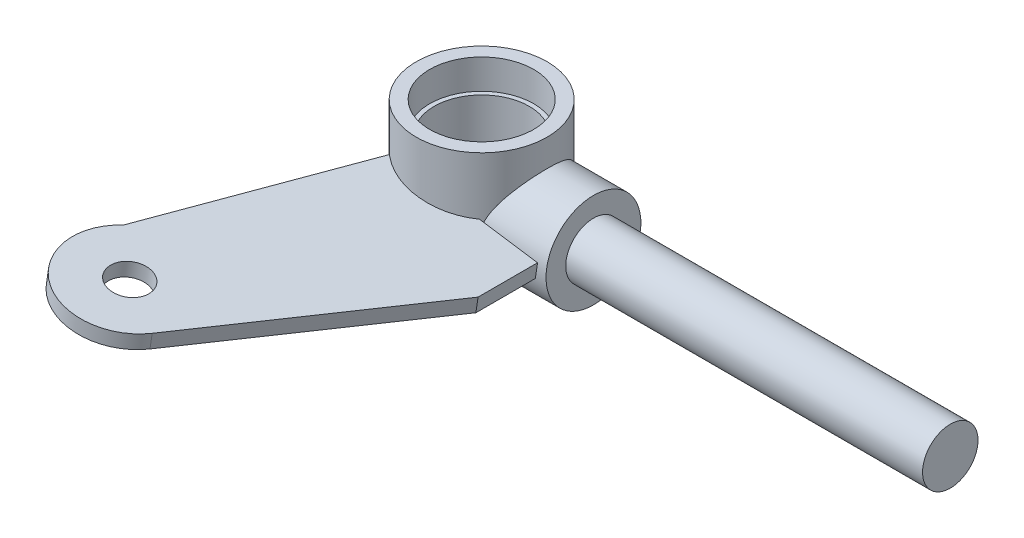
ISO-10303-21;
HEADER;
FILE_DESCRIPTION(('STEP AP214'),'2;1');
FILE_NAME('part.step','',(''),(''),'','','');
FILE_SCHEMA(('AUTOMOTIVE_DESIGN { 1 0 10303 214 1 1 1 1 }'));
ENDSEC;
DATA;
#1=APPLICATION_CONTEXT('core data for automotive mechanical design processes');
#2=APPLICATION_PROTOCOL_DEFINITION('international standard','automotive_design',2000,#1);
#3=PRODUCT_CONTEXT('',#1,'mechanical');
#4=PRODUCT('Part','Part','',(#3));
#5=PRODUCT_RELATED_PRODUCT_CATEGORY('part','',(#4));
#6=PRODUCT_DEFINITION_FORMATION('','',#4);
#7=PRODUCT_DEFINITION_CONTEXT('part definition',#1,'design');
#8=PRODUCT_DEFINITION('design','',#6,#7);
#9=PRODUCT_DEFINITION_SHAPE('','',#8);
#10=(LENGTH_UNIT() NAMED_UNIT(*) SI_UNIT(.MILLI.,.METRE.));
#11=(NAMED_UNIT(*) PLANE_ANGLE_UNIT() SI_UNIT($,.RADIAN.));
#12=(NAMED_UNIT(*) SI_UNIT($,.STERADIAN.) SOLID_ANGLE_UNIT());
#13=UNCERTAINTY_MEASURE_WITH_UNIT(LENGTH_MEASURE(1.E-05),#10,'distance_accuracy_value','');
#14=(GEOMETRIC_REPRESENTATION_CONTEXT(3) GLOBAL_UNCERTAINTY_ASSIGNED_CONTEXT((#13)) GLOBAL_UNIT_ASSIGNED_CONTEXT((#10,
#11,#12)) REPRESENTATION_CONTEXT('',''));
#15=CARTESIAN_POINT('',(0.,0.,0.));
#16=DIRECTION('',(0.,0.,1.));
#17=DIRECTION('',(1.,0.,0.));
#18=AXIS2_PLACEMENT_3D('',#15,#16,#17);
#19=CARTESIAN_POINT('',(-214.099905565846,-12.3825,0.));
#20=DIRECTION('',(0.,-1.,0.));
#21=DIRECTION('',(0.,0.,-1.));
#22=AXIS2_PLACEMENT_3D('',#19,#20,#21);
#23=PLANE('',#22);
#24=CARTESIAN_POINT('',(-200.129905565846,-12.3825,0.));
#25=DIRECTION('',(0.,1.,0.));
#26=DIRECTION('',(0.,0.,-1.));
#27=AXIS2_PLACEMENT_3D('',#24,#25,#26);
#28=CIRCLE('',#27,13.97);
#29=CARTESIAN_POINT('',(-200.129905565846,-12.3825,-13.97));
#30=VERTEX_POINT('',#29);
#31=EDGE_CURVE('E73',#30,#30,#28,.T.);
#32=ORIENTED_EDGE('',*,*,#31,.F.);
#33=EDGE_LOOP('',(#32));
#34=FACE_BOUND('',#33,.T.);
#35=CARTESIAN_POINT('',(-200.129905565846,-12.3825,0.));
#36=DIRECTION('',(0.,1.,0.));
#37=DIRECTION('',(0.,0.,-1.));
#38=AXIS2_PLACEMENT_3D('',#35,#36,#37);
#39=CIRCLE('',#38,11.1125);
#40=CARTESIAN_POINT('',(-200.129905565846,-12.3825,-11.1125));
#41=VERTEX_POINT('',#40);
#42=EDGE_CURVE('E11',#41,#41,#39,.T.);
#43=ORIENTED_EDGE('',*,*,#42,.T.);
#44=EDGE_LOOP('',(#43));
#45=FACE_BOUND('',#44,.T.);
#46=ADVANCED_FACE('F45',(#34,#45),#23,.T.);
#47=CARTESIAN_POINT('',(-200.129905565846,-12.3825,0.));
#48=DIRECTION('',(0.,-1.,0.));
#49=DIRECTION('',(0.,0.,-1.));
#50=AXIS2_PLACEMENT_3D('',#47,#48,#49);
#51=CYLINDRICAL_SURFACE('',#50,11.1125);
#52=ORIENTED_EDGE('',*,*,#42,.F.);
#53=EDGE_LOOP('',(#52));
#54=FACE_BOUND('',#53,.T.);
#55=CARTESIAN_POINT('',(-200.129905565846,-6.0325,0.));
#56=DIRECTION('',(0.,1.,0.));
#57=DIRECTION('',(0.,0.,-1.));
#58=AXIS2_PLACEMENT_3D('',#55,#56,#57);
#59=CIRCLE('',#58,11.1125);
#60=CARTESIAN_POINT('',(-200.129905565846,-6.0325,-11.1125));
#61=VERTEX_POINT('',#60);
#62=EDGE_CURVE('E51',#61,#61,#59,.T.);
#63=ORIENTED_EDGE('',*,*,#62,.T.);
#64=EDGE_LOOP('',(#63));
#65=FACE_BOUND('',#64,.T.);
#66=ADVANCED_FACE('F80',(#54,#65),#51,.F.);
#67=CARTESIAN_POINT('',(-211.242405565846,-6.0325,0.));
#68=DIRECTION('',(0.,-1.,0.));
#69=DIRECTION('',(0.,0.,-1.));
#70=AXIS2_PLACEMENT_3D('',#67,#68,#69);
#71=PLANE('',#70);
#72=ORIENTED_EDGE('',*,*,#62,.F.);
#73=EDGE_LOOP('',(#72));
#74=FACE_BOUND('',#73,.T.);
#75=CARTESIAN_POINT('',(-200.129905565846,-6.0325,0.));
#76=DIRECTION('',(0.,1.,0.));
#77=DIRECTION('',(0.,0.,-1.));
#78=AXIS2_PLACEMENT_3D('',#75,#76,#77);
#79=CIRCLE('',#78,10.16);
#80=CARTESIAN_POINT('',(-200.129905565846,-6.0325,-10.16));
#81=VERTEX_POINT('',#80);
#82=EDGE_CURVE('E55',#81,#81,#79,.T.);
#83=ORIENTED_EDGE('',*,*,#82,.T.);
#84=EDGE_LOOP('',(#83));
#85=FACE_BOUND('',#84,.T.);
#86=ADVANCED_FACE('F84',(#74,#85),#71,.T.);
#87=CARTESIAN_POINT('',(-200.129905565846,-12.3825,0.));
#88=DIRECTION('',(0.,-1.,0.));
#89=DIRECTION('',(0.,0.,-1.));
#90=AXIS2_PLACEMENT_3D('',#87,#88,#89);
#91=CYLINDRICAL_SURFACE('',#90,10.16);
#92=ORIENTED_EDGE('',*,*,#82,.F.);
#93=EDGE_LOOP('',(#92));
#94=FACE_BOUND('',#93,.T.);
#95=CARTESIAN_POINT('',(-200.129905565846,6.0325,0.));
#96=DIRECTION('',(0.,1.,0.));
#97=DIRECTION('',(0.,0.,-1.));
#98=AXIS2_PLACEMENT_3D('',#95,#96,#97);
#99=CIRCLE('',#98,10.16);
#100=CARTESIAN_POINT('',(-200.129905565846,6.0325,-10.16));
#101=VERTEX_POINT('',#100);
#102=EDGE_CURVE('E59',#101,#101,#99,.T.);
#103=ORIENTED_EDGE('',*,*,#102,.T.);
#104=EDGE_LOOP('',(#103));
#105=FACE_BOUND('',#104,.T.);
#106=ADVANCED_FACE('F89',(#94,#105),#91,.F.);
#107=CARTESIAN_POINT('',(-211.242405565846,6.0325,0.));
#108=DIRECTION('',(0.,1.,0.));
#109=DIRECTION('',(0.,0.,1.));
#110=AXIS2_PLACEMENT_3D('',#107,#108,#109);
#111=PLANE('',#110);
#112=ORIENTED_EDGE('',*,*,#102,.F.);
#113=EDGE_LOOP('',(#112));
#114=FACE_BOUND('',#113,.T.);
#115=CARTESIAN_POINT('',(-200.129905565846,6.0325,0.));
#116=DIRECTION('',(0.,1.,0.));
#117=DIRECTION('',(0.,0.,-1.));
#118=AXIS2_PLACEMENT_3D('',#115,#116,#117);
#119=CIRCLE('',#118,11.1125);
#120=CARTESIAN_POINT('',(-200.129905565846,6.0325,-11.1125));
#121=VERTEX_POINT('',#120);
#122=EDGE_CURVE('E64',#121,#121,#119,.T.);
#123=ORIENTED_EDGE('',*,*,#122,.T.);
#124=EDGE_LOOP('',(#123));
#125=FACE_BOUND('',#124,.T.);
#126=ADVANCED_FACE('F95',(#114,#125),#111,.T.);
#127=CARTESIAN_POINT('',(-200.129905565846,-12.3825,0.));
#128=DIRECTION('',(0.,-1.,0.));
#129=DIRECTION('',(0.,0.,-1.));
#130=AXIS2_PLACEMENT_3D('',#127,#128,#129);
#131=CYLINDRICAL_SURFACE('',#130,11.1125);
#132=ORIENTED_EDGE('',*,*,#122,.F.);
#133=EDGE_LOOP('',(#132));
#134=FACE_BOUND('',#133,.T.);
#135=CARTESIAN_POINT('',(-200.129905565846,12.3825,0.));
#136=DIRECTION('',(0.,1.,0.));
#137=DIRECTION('',(0.,0.,-1.));
#138=AXIS2_PLACEMENT_3D('',#135,#136,#137);
#139=CIRCLE('',#138,11.1125);
#140=CARTESIAN_POINT('',(-200.129905565846,12.3825,-11.1125));
#141=VERTEX_POINT('',#140);
#142=EDGE_CURVE('E67',#141,#141,#139,.T.);
#143=ORIENTED_EDGE('',*,*,#142,.T.);
#144=EDGE_LOOP('',(#143));
#145=FACE_BOUND('',#144,.T.);
#146=ADVANCED_FACE('F99',(#134,#145),#131,.F.);
#147=CARTESIAN_POINT('',(-214.099905565846,12.3825,0.));
#148=DIRECTION('',(0.,1.,0.));
#149=DIRECTION('',(0.,0.,1.));
#150=AXIS2_PLACEMENT_3D('',#147,#148,#149);
#151=PLANE('',#150);
#152=ORIENTED_EDGE('',*,*,#142,.F.);
#153=EDGE_LOOP('',(#152));
#154=FACE_BOUND('',#153,.T.);
#155=CARTESIAN_POINT('',(-200.129905565846,12.3825,0.));
#156=DIRECTION('',(0.,1.,0.));
#157=DIRECTION('',(0.,0.,-1.));
#158=AXIS2_PLACEMENT_3D('',#155,#156,#157);
#159=CIRCLE('',#158,13.97);
#160=CARTESIAN_POINT('',(-200.129905565846,12.3825,-13.97));
#161=VERTEX_POINT('',#160);
#162=EDGE_CURVE('E70',#161,#161,#159,.T.);
#163=ORIENTED_EDGE('',*,*,#162,.T.);
#164=EDGE_LOOP('',(#163));
#165=FACE_BOUND('',#164,.T.);
#166=ADVANCED_FACE('F103',(#154,#165),#151,.T.);
#167=CARTESIAN_POINT('',(-200.129905565846,-12.3825,0.));
#168=DIRECTION('',(0.,-1.,0.));
#169=DIRECTION('',(0.,0.,-1.));
#170=AXIS2_PLACEMENT_3D('',#167,#168,#169);
#171=CYLINDRICAL_SURFACE('',#170,13.97);
#172=ORIENTED_EDGE('',*,*,#162,.F.);
#173=EDGE_LOOP('',(#172));
#174=FACE_BOUND('',#173,.T.);
#175=ORIENTED_EDGE('',*,*,#31,.T.);
#176=EDGE_LOOP('',(#175));
#177=FACE_BOUND('',#176,.T.);
#178=ADVANCED_FACE('F77',(#174,#177),#171,.T.);
#179=CLOSED_SHELL('',(#46,#66,#86,#106,#126,#146,#166,#178));
#180=MANIFOLD_SOLID_BREP('B2',#179);
#181=CARTESIAN_POINT('',(-176.264952782923,-3.56664109055751,0.));
#182=DIRECTION('',(-1.,0.,0.));
#183=DIRECTION('',(0.,0.,-1.));
#184=AXIS2_PLACEMENT_3D('',#181,#182,#183);
#185=CYLINDRICAL_SURFACE('',#184,10.1308937353786);
#186=CARTESIAN_POINT('',(-176.264952782923,-3.56664109055751,0.));
#187=DIRECTION('',(-1.,0.,0.));
#188=DIRECTION('',(0.,0.,1.));
#189=AXIS2_PLACEMENT_3D('',#186,#187,#188);
#190=CIRCLE('',#189,10.1308937353786);
#191=CARTESIAN_POINT('',(-176.264952782923,-3.56664109055751,10.1308937353787));
#192=VERTEX_POINT('',#191);
#193=EDGE_CURVE('E178',#192,#192,#190,.T.);
#194=ORIENTED_EDGE('',*,*,#193,.T.);
#195=EDGE_LOOP('',(#194));
#196=FACE_BOUND('',#195,.T.);
#197=CARTESIAN_POINT('',(-190.510867561843,-3.56664109055751,10.1308937353787));
#198=CARTESIAN_POINT('',(-190.510865170661,-3.80639849007304,10.1308925484275));
#199=CARTESIAN_POINT('',(-190.501857299438,-4.04617130452357,10.1223617673848));
#200=CARTESIAN_POINT('',(-190.466342566868,-4.52332005065299,10.088460451511));
#201=CARTESIAN_POINT('',(-190.439825688999,-4.76069453133077,10.0630802774652));
#202=CARTESIAN_POINT('',(-190.370675006353,-5.23127763039903,9.99603045747906));
#203=CARTESIAN_POINT('',(-190.328004015223,-5.46447532682341,9.95432321945608));
#204=CARTESIAN_POINT('',(-190.228623758473,-5.92461065115534,9.8554765170672));
#205=CARTESIAN_POINT('',(-190.171906399991,-6.15154458610549,9.79832815451213));
#206=CARTESIAN_POINT('',(-190.047637530093,-6.59500296099345,9.67039785709464));
#207=CARTESIAN_POINT('',(-189.980237734968,-6.81162484133087,9.59980439757007));
#208=CARTESIAN_POINT('',(-189.836383515067,-7.23689009378552,9.44539414340225));
#209=CARTESIAN_POINT('',(-189.759929955346,-7.4455342256309,9.36157861182486));
#210=CARTESIAN_POINT('',(-189.520233702876,-8.05899105580503,9.09139352136986));
#211=CARTESIAN_POINT('',(-189.34655692559,-8.45165774662794,8.88618852556372));
#212=CARTESIAN_POINT('',(-189.059175768392,-9.05057278524142,8.52232525593787));
#213=CARTESIAN_POINT('',(-188.949578453435,-9.26806242968695,8.37833864467594));
#214=CARTESIAN_POINT('',(-188.728261408459,-9.69069470769071,8.07456910940666));
#215=CARTESIAN_POINT('',(-188.616541509947,-9.89583635561966,7.91478492710447));
#216=CARTESIAN_POINT('',(-188.393199817875,-10.2935623005356,7.57966098880922));
#217=CARTESIAN_POINT('',(-188.281578334848,-10.4861301228153,7.40430150800251));
#218=CARTESIAN_POINT('',(-188.060696800817,-10.8578860164378,7.03851926498493));
#219=CARTESIAN_POINT('',(-187.951436929129,-11.0370730743084,6.84809536402511));
#220=CARTESIAN_POINT('',(-187.717479969809,-11.4131649892626,6.41588768798284));
#221=CARTESIAN_POINT('',(-187.593667666429,-11.6072125319033,6.17112054980705));
#222=CARTESIAN_POINT('',(-187.355450590306,-11.9737930574009,5.66156410722473));
#223=CARTESIAN_POINT('',(-187.241047737734,-12.1463216526137,5.39677073715653));
#224=CARTESIAN_POINT('',(-187.025066254435,-12.4674846211503,4.8487799701303));
#225=CARTESIAN_POINT('',(-186.92346539792,-12.6161605317473,4.56561579931963));
#226=CARTESIAN_POINT('',(-186.73600514527,-12.8876020711898,3.98221905452539));
#227=CARTESIAN_POINT('',(-186.650138189377,-13.0103801476271,3.6819947688406));
#228=CARTESIAN_POINT('',(-186.518894006397,-13.1966336019867,3.15477503796828));
#229=CARTESIAN_POINT('',(-186.46895505328,-13.2670334245227,2.93133323530669));
#230=CARTESIAN_POINT('',(-186.379529710498,-13.392570600585,2.47817568608821));
#231=CARTESIAN_POINT('',(-186.340040970482,-13.4477113861407,2.2484613631241));
#232=CARTESIAN_POINT('',(-186.272337240398,-13.5419798008082,1.78428620306751));
#233=CARTESIAN_POINT('',(-186.244114931068,-13.5811178265519,1.5498285518643));
#234=CARTESIAN_POINT('',(-186.199511188905,-13.6428731553088,1.07761343482733));
#235=CARTESIAN_POINT('',(-186.183130169543,-13.6654898814359,0.839855854062936));
#236=CARTESIAN_POINT('',(-186.162553510575,-13.6938878916493,0.362262652436685));
#237=CARTESIAN_POINT('',(-186.158385723091,-13.6996306950487,0.12242353087556));
#238=CARTESIAN_POINT('',(-186.162409740995,-13.6940815897164,-0.356951834590637));
#239=CARTESIAN_POINT('',(-186.170601498993,-13.682789746303,-0.596488079653545));
#240=CARTESIAN_POINT('',(-186.199161231456,-13.6433434302408,-1.07348204017368));
#241=CARTESIAN_POINT('',(-186.219531871128,-13.6151852665927,-1.31093928912261));
#242=CARTESIAN_POINT('',(-186.271999678066,-13.5424266781346,-1.78199605263436));
#243=CARTESIAN_POINT('',(-186.304096812869,-13.4978262988436,-2.01559557787512));
#244=CARTESIAN_POINT('',(-186.378250939355,-13.3943252629383,-2.47073456285514));
#245=CARTESIAN_POINT('',(-186.419994875835,-13.3358728600535,-2.69242764401206));
#246=CARTESIAN_POINT('',(-186.513125256935,-13.2047397005971,-3.12956162592219));
#247=CARTESIAN_POINT('',(-186.564515070187,-13.132053972933,-3.34500031200946));
#248=CARTESIAN_POINT('',(-186.676004174886,-12.9732751607129,-3.76847042647943));
#249=CARTESIAN_POINT('',(-186.736101143764,-12.8871856510606,-3.97650381179521));
#250=CARTESIAN_POINT('',(-186.864049919499,-12.702366642786,-4.3844844700079));
#251=CARTESIAN_POINT('',(-186.9319045359,-12.6036325631847,-4.58442877760946));
#252=CARTESIAN_POINT('',(-187.082180389752,-12.3827907472346,-4.9971150380558));
#253=CARTESIAN_POINT('',(-187.165382795245,-12.2593060849262,-5.20883565069019));
#254=CARTESIAN_POINT('',(-187.338640000657,-11.9987261472283,-5.62089044097813));
#255=CARTESIAN_POINT('',(-187.428697701676,-11.861625101942,-5.82121973456839));
#256=CARTESIAN_POINT('',(-187.614222384459,-11.5746637198013,-6.21007304769011));
#257=CARTESIAN_POINT('',(-187.709692632778,-11.4247956498306,-6.39858979053962));
#258=CARTESIAN_POINT('',(-187.904501848188,-11.1131238721971,-6.7633697865122));
#259=CARTESIAN_POINT('',(-188.003841256385,-10.9513188017592,-6.93963163609259));
#260=CARTESIAN_POINT('',(-188.223813109371,-10.5847977195688,-7.31169885898193));
#261=CARTESIAN_POINT('',(-188.344928514931,-10.3777434401458,-7.50492223431331));
#262=CARTESIAN_POINT('',(-188.587755657189,-9.94838845974053,-7.87326842070623));
#263=CARTESIAN_POINT('',(-188.709467508349,-9.72608471665142,-8.04838760260165));
#264=CARTESIAN_POINT('',(-188.950549143286,-9.26667224415712,-8.38002952893087));
#265=CARTESIAN_POINT('',(-189.069918408687,-9.02956028541537,-8.53654819525789));
#266=CARTESIAN_POINT('',(-189.302865192021,-8.54107815226735,-8.83013329096766));
#267=CARTESIAN_POINT('',(-189.416444239088,-8.28971177973054,-8.96720487334645));
#268=CARTESIAN_POINT('',(-189.695347709389,-7.62721997990816,-9.29241023498745));
#269=CARTESIAN_POINT('',(-189.853892509947,-7.20568192841436,-9.46596501358645));
#270=CARTESIAN_POINT('',(-190.060846906272,-6.55040855821285,-9.68427081004706));
#271=CARTESIAN_POINT('',(-190.124658015734,-6.32830056588316,-9.75000737366088));
#272=CARTESIAN_POINT('',(-190.239706427697,-5.87698619457917,-9.86668962366788));
#273=CARTESIAN_POINT('',(-190.290946242134,-5.64778124400931,-9.91763826528413));
#274=CARTESIAN_POINT('',(-190.37152959568,-5.22091458018934,-9.99688268890803));
#275=CARTESIAN_POINT('',(-190.403067701373,-5.02409582629009,-10.0275019956832));
#276=CARTESIAN_POINT('',(-190.454538892576,-4.6275136576214,-10.077175547512));
#277=CARTESIAN_POINT('',(-190.474474337349,-4.42775084996649,-10.0962321437387));
#278=CARTESIAN_POINT('',(-190.501947587473,-4.02671672226621,-10.1224349906279));
#279=CARTESIAN_POINT('',(-190.509493285881,-3.82544644474953,-10.1295888241473));
#280=CARTESIAN_POINT('',(-190.511898601351,-3.42275529878834,-10.1318727471276));
#281=CARTESIAN_POINT('',(-190.506757919964,-3.2213344269125,-10.1270025537211));
#282=CARTESIAN_POINT('',(-190.484021473576,-2.82015303979755,-10.1053481719862));
#283=CARTESIAN_POINT('',(-190.466444251103,-2.62039050009428,-10.0885817205351));
#284=CARTESIAN_POINT('',(-190.419558064362,-2.22359057700764,-10.0434606985891));
#285=CARTESIAN_POINT('',(-190.39024913301,-2.0265531859801,-10.015106160606));
#286=CARTESIAN_POINT('',(-190.320937429423,-1.6361160617716,-9.9472303117203));
#287=CARTESIAN_POINT('',(-190.280923122836,-1.44272049442085,-9.90769695372881));
#288=CARTESIAN_POINT('',(-190.191501744549,-1.06054152358299,-9.81799555196963));
#289=CARTESIAN_POINT('',(-190.142089340745,-0.871760807328801,-9.76782146921262));
#290=CARTESIAN_POINT('',(-190.013575712895,-0.423853421042502,-9.63495869026008));
#291=CARTESIAN_POINT('',(-189.930567664562,-0.167299199204758,-9.54734104960244));
#292=CARTESIAN_POINT('',(-189.752611346491,0.33430611751025,-9.35360629636576));
#293=CARTESIAN_POINT('',(-189.657663153956,0.579357286751399,-9.24748930340056));
#294=CARTESIAN_POINT('',(-189.459122891577,1.05799001089977,-9.01767125631352));
#295=CARTESIAN_POINT('',(-189.355515551459,1.2915500983756,-8.89393885548552));
#296=CARTESIAN_POINT('',(-189.142895831954,1.74644839226086,-8.62990435905117));
#297=CARTESIAN_POINT('',(-189.033884010833,1.96778785605097,-8.48960397280574));
#298=CARTESIAN_POINT('',(-188.809899428763,2.40435294955986,-8.18868526639419));
#299=CARTESIAN_POINT('',(-188.694845599498,2.61920935204988,-8.02759203023274));
#300=CARTESIAN_POINT('',(-188.464453549773,3.03539669583716,-7.68895804136306));
#301=CARTESIAN_POINT('',(-188.349115316403,3.23672701096218,-7.5114165281076));
#302=CARTESIAN_POINT('',(-188.120647266923,3.62509143227999,-7.14044990952773));
#303=CARTESIAN_POINT('',(-188.007515364398,3.81213958654222,-6.94704081063138));
#304=CARTESIAN_POINT('',(-187.785529093355,4.17142654750338,-6.54447239318096));
#305=CARTESIAN_POINT('',(-187.67667615877,4.34366041234396,-6.33530786212545));
#306=CARTESIAN_POINT('',(-187.470695034312,4.66403356177298,-5.91251250663101));
#307=CARTESIAN_POINT('',(-187.373252992555,4.81294498034246,-5.6996205530482));
#308=CARTESIAN_POINT('',(-187.186071368422,5.09523556233258,-5.26069786253673));
#309=CARTESIAN_POINT('',(-187.096327971032,5.2286224306741,-5.0346737274116));
#310=CARTESIAN_POINT('',(-186.92626599109,5.47872307569742,-4.57011857790838));
#311=CARTESIAN_POINT('',(-186.845948606755,5.59543473306985,-4.33158597904409));
#312=CARTESIAN_POINT('',(-186.696490807179,5.81081876001885,-3.8431096419196));
#313=CARTESIAN_POINT('',(-186.627350309506,5.90949126264096,-3.5931659878372));
#314=CARTESIAN_POINT('',(-186.501355467379,6.0881781687157,-3.08116744840379));
#315=CARTESIAN_POINT('',(-186.444609317258,6.16802871246312,-2.81902839880318));
#316=CARTESIAN_POINT('',(-186.345639301839,6.30667972615402,-2.28653086208384));
#317=CARTESIAN_POINT('',(-186.303415620167,6.36547992993114,-2.01617227108183));
#318=CARTESIAN_POINT('',(-186.234717877128,6.46089325607901,-1.46982675384621));
#319=CARTESIAN_POINT('',(-186.208230130106,6.49752565846373,-1.19384493490774));
#320=CARTESIAN_POINT('',(-186.171745097232,6.54793547020552,-0.638735201978661));
#321=CARTESIAN_POINT('',(-186.16174524821,6.56171643199589,-0.359607783789672));
#322=CARTESIAN_POINT('',(-186.158755529757,6.56583795252878,0.159413192084113));
#323=CARTESIAN_POINT('',(-186.163561801319,6.55921549763676,0.399277514995676));
#324=CARTESIAN_POINT('',(-186.185430467002,6.52903147048661,0.877354922388151));
#325=CARTESIAN_POINT('',(-186.2024914906,6.50547179242046,1.11556818850919));
#326=CARTESIAN_POINT('',(-186.248488565024,6.44177184925209,1.58859789337558));
#327=CARTESIAN_POINT('',(-186.277424884528,6.40163120900632,1.8234142551417));
#328=CARTESIAN_POINT('',(-186.346549683206,6.30534603610142,2.28804988925624));
#329=CARTESIAN_POINT('',(-186.386738517723,6.24920099804036,2.51786900355016));
#330=CARTESIAN_POINT('',(-186.47668308947,6.12286458200034,2.96678777092029));
#331=CARTESIAN_POINT('',(-186.526242285086,6.05296073537101,3.18600817588903));
#332=CARTESIAN_POINT('',(-186.634507789848,5.89923694826681,3.61726235028899));
#333=CARTESIAN_POINT('',(-186.693217276333,5.81541217323288,3.82929359210398));
#334=CARTESIAN_POINT('',(-186.818750872084,5.63472663802529,4.24514110928427));
#335=CARTESIAN_POINT('',(-186.885572493146,5.53786987411879,4.44895987820898));
#336=CARTESIAN_POINT('',(-187.026312378325,5.33189351278721,4.84783428956795));
#337=CARTESIAN_POINT('',(-187.100233178177,5.22276953127871,5.04288676400262));
#338=CARTESIAN_POINT('',(-187.264316770513,4.97776246672566,5.44900506020996));
#339=CARTESIAN_POINT('',(-187.355331631067,4.84025107136051,5.65874481038789));
#340=CARTESIAN_POINT('',(-187.543490283896,4.55148431377991,6.06575202179336));
#341=CARTESIAN_POINT('',(-187.640636717347,4.40022301627013,6.2630140339654));
#342=CARTESIAN_POINT('',(-187.839519797603,4.08468018068767,6.64482533350068));
#343=CARTESIAN_POINT('',(-187.941261903571,3.92038297231731,6.82935880653217));
#344=CARTESIAN_POINT('',(-188.147517879682,3.57969358465794,7.1850924332814));
#345=CARTESIAN_POINT('',(-188.252030967753,3.40330479623322,7.35629629651574));
#346=CARTESIAN_POINT('',(-188.481969990692,3.00449779613303,7.71623517005947));
#347=CARTESIAN_POINT('',(-188.60761836658,2.77967722820198,7.90217618090311));
#348=CARTESIAN_POINT('',(-188.857292609353,2.31421952225714,8.25443630149155));
#349=CARTESIAN_POINT('',(-188.981318054559,2.07357836777106,8.42075039824056));
#350=CARTESIAN_POINT('',(-189.224133308826,1.5769799699955,8.73293186636329));
#351=CARTESIAN_POINT('',(-189.34292542981,1.32102961008681,8.87880832982478));
#352=CARTESIAN_POINT('',(-189.571163708305,0.794270740970728,9.14905212486614));
#353=CARTESIAN_POINT('',(-189.680614111932,0.523469075096433,9.27342925523373));
#354=CARTESIAN_POINT('',(-189.927886014706,-0.147807927528755,9.54599963851675));
#355=CARTESIAN_POINT('',(-190.058799644939,-0.555714314304149,9.68286968729266));
#356=CARTESIAN_POINT('',(-190.222569691282,-1.18537456282062,9.84945002462023));
#357=CARTESIAN_POINT('',(-190.271689866527,-1.39798272775062,9.8984897074791));
#358=CARTESIAN_POINT('',(-190.35733148731,-1.82833914504426,9.98305180029199));
#359=CARTESIAN_POINT('',(-190.39385883294,-2.04608493905188,10.0185805413043));
#360=CARTESIAN_POINT('',(-190.452021634122,-2.48006028989114,10.074773994129));
#361=CARTESIAN_POINT('',(-190.473993411898,-2.69620084434266,10.0957749346338));
#362=CARTESIAN_POINT('',(-190.503419304707,-3.13043672258906,10.1238371131521));
#363=CARTESIAN_POINT('',(-190.510869737113,-3.34853252815357,10.1308948151543));
#364=CARTESIAN_POINT('',(-190.510867561843,-3.56664109055751,10.1308937353787));
#365=B_SPLINE_CURVE_WITH_KNOTS('',3,(#197,#198,#199,#200,#201,#202,#203,#204,#205,#206,#207,
#208,#209,#210,#211,#212,#213,#214,#215,#216,#217,#218,#219,#220,#221,#222,#223,#224,#225,#226,
#227,#228,#229,#230,#231,#232,#233,#234,#235,#236,#237,#238,#239,#240,#241,#242,#243,#244,#245,
#246,#247,#248,#249,#250,#251,#252,#253,#254,#255,#256,#257,#258,#259,#260,#261,#262,#263,#264,
#265,#266,#267,#268,#269,#270,#271,#272,#273,#274,#275,#276,#277,#278,#279,#280,#281,#282,#283,
#284,#285,#286,#287,#288,#289,#290,#291,#292,#293,#294,#295,#296,#297,#298,#299,#300,#301,#302,
#303,#304,#305,#306,#307,#308,#309,#310,#311,#312,#313,#314,#315,#316,#317,#318,#319,#320,#321,
#322,#323,#324,#325,#326,#327,#328,#329,#330,#331,#332,#333,#334,#335,#336,#337,#338,#339,#340,
#341,#342,#343,#344,#345,#346,#347,#348,#349,#350,#351,#352,#353,#354,#355,#356,#357,#358,#359,
#360,#361,#362,#363,#364),.UNSPECIFIED.,.T.,.F.,(4,2,2,2,2,2,2,2,2,2,2,2,2,2,2,2,2,2,2,2,2,2,2,
2,2,2,2,2,2,2,2,2,2,2,2,2,2,2,2,2,2,2,2,2,2,2,2,2,2,2,2,2,2,2,2,2,2,2,2,2,2,2,2,2,2,2,2,2,2,2,2,
2,2,2,2,2,2,2,2,2,2,2,2,4),(0.,0.718986430556502,1.43838453432068,2.15944884422623,
2.88092956821217,3.59295563755625,4.30491373027604,5.72776731350085,6.57598137740764,
7.42426305706004,8.27363476416965,9.12307073841017,10.1296948523243,11.1365238792831,
12.1415801146481,13.1461521712457,13.8640302461093,14.5817467259189,15.2989961777896,
16.0162706731741,16.7351796358587,17.4540858419387,18.1731494298418,18.8922110270861,
19.5905886992465,20.2892107213435,20.9876467331289,21.6863364996942,22.4621002275027,
23.2381940966427,24.0147614424422,24.7914175818404,25.714522601662,26.6378123097395,
27.5613040742839,28.4845506775028,29.9265069423248,30.6465965896972,31.3665422348896,
31.9709148179918,32.5751644661552,33.1790290192293,33.782907778455,34.3858880638182,
34.9888666574522,35.5924975564188,36.1964719585592,37.0457694927818,37.8950615357868,
38.7458842406101,39.5966192404727,40.4722840821963,41.3479894337663,42.2228220302062,
43.0979453368963,43.9295666705423,44.7607734897943,45.5920858561592,46.4233920910355,
47.2616882272785,48.099994962797,48.9375715455123,49.7750179082545,50.4941329360237,
51.2131675533241,51.9322184396432,52.6512920353434,53.3566862334085,54.0623259200509,
54.7677497129391,55.4734264179514,56.2730674837934,57.0730553775135,57.8740199357032,
58.6747607895957,59.6267026398152,60.5788871058234,61.5306466193494,62.4819711974511,
63.8255216151532,64.4958132474092,65.1657904012277,65.8196903157807,66.4737560383548),.UNSPECIFIED.);
#366=CARTESIAN_POINT('',(-190.510867561843,-3.56664109055751,10.1308937353787));
#367=VERTEX_POINT('',#366);
#368=EDGE_CURVE('E186',#367,#367,#365,.T.);
#369=ORIENTED_EDGE('',*,*,#368,.T.);
#370=EDGE_LOOP('',(#369));
#371=FACE_BOUND('',#370,.T.);
#372=ADVANCED_FACE('F175',(#196,#371),#185,.T.);
#373=CARTESIAN_POINT('',(-176.264952782923,-3.56664109055751,0.));
#374=DIRECTION('',(1.,0.,0.));
#375=DIRECTION('',(0.,0.,1.));
#376=AXIS2_PLACEMENT_3D('',#373,#374,#375);
#377=PLANE('',#376);
#378=CARTESIAN_POINT('',(-176.264952782923,-3.56664109055751,0.));
#379=DIRECTION('',(-1.,0.,0.));
#380=DIRECTION('',(0.,0.,1.));
#381=AXIS2_PLACEMENT_3D('',#378,#379,#380);
#382=CIRCLE('',#381,5.92106637307848);
#383=CARTESIAN_POINT('',(-176.264952782923,-3.56664109055751,-5.92106637307846));
#384=VERTEX_POINT('',#383);
#385=EDGE_CURVE('E44',#384,#384,#382,.T.);
#386=ORIENTED_EDGE('',*,*,#385,.T.);
#387=EDGE_LOOP('',(#386));
#388=FACE_BOUND('',#387,.T.);
#389=ORIENTED_EDGE('',*,*,#193,.F.);
#390=EDGE_LOOP('',(#389));
#391=FACE_BOUND('',#390,.T.);
#392=ADVANCED_FACE('F210',(#388,#391),#377,.T.);
#393=CARTESIAN_POINT('',(-200.129905565846,-12.3825,0.));
#394=DIRECTION('',(0.,-1.,0.));
#395=DIRECTION('',(0.,0.,-1.));
#396=AXIS2_PLACEMENT_3D('',#393,#394,#395);
#397=CYLINDRICAL_SURFACE('',#396,13.97);
#398=ORIENTED_EDGE('',*,*,#368,.F.);
#399=EDGE_LOOP('',(#398));
#400=FACE_BOUND('',#399,.T.);
#401=ADVANCED_FACE('F195',(#400),#397,.F.);
#402=CARTESIAN_POINT('',(-100.064952782923,-3.56664109055751,0.));
#403=DIRECTION('',(-1.,0.,0.));
#404=DIRECTION('',(0.,0.,-1.));
#405=AXIS2_PLACEMENT_3D('',#402,#403,#404);
#406=CYLINDRICAL_SURFACE('',#405,5.92106637307848);
#407=CARTESIAN_POINT('',(-100.064952782923,-3.56664109055751,0.));
#408=DIRECTION('',(-1.,0.,0.));
#409=DIRECTION('',(0.,0.,1.));
#410=AXIS2_PLACEMENT_3D('',#407,#408,#409);
#411=CIRCLE('',#410,5.92106637307848);
#412=CARTESIAN_POINT('',(-100.064952782923,-3.56664109055751,-5.92106637307847));
#413=VERTEX_POINT('',#412);
#414=EDGE_CURVE('E188',#413,#413,#411,.T.);
#415=CARTESIAN_POINT('',(-100.064952782923,-3.56664109055751,-5.92106637307847));
#416=CARTESIAN_POINT('',(-100.858702782923,-3.56664109055751,-5.92106637307847));
#417=CARTESIAN_POINT('',(-101.652452782923,-3.56664109055751,-5.92106637307847));
#418=CARTESIAN_POINT('',(-103.239952782923,-3.56664109055751,-5.92106637307847));
#419=CARTESIAN_POINT('',(-104.033702782923,-3.56664109055751,-5.92106637307847));
#420=CARTESIAN_POINT('',(-105.621202782923,-3.56664109055751,-5.92106637307847));
#421=CARTESIAN_POINT('',(-106.414952782923,-3.56664109055751,-5.92106637307847));
#422=CARTESIAN_POINT('',(-108.002452782923,-3.56664109055751,-5.92106637307847));
#423=CARTESIAN_POINT('',(-108.796202782923,-3.56664109055751,-5.92106637307847));
#424=CARTESIAN_POINT('',(-110.383702782923,-3.56664109055751,-5.92106637307847));
#425=CARTESIAN_POINT('',(-111.177452782923,-3.56664109055751,-5.92106637307847));
#426=CARTESIAN_POINT('',(-112.764952782923,-3.56664109055751,-5.92106637307847));
#427=CARTESIAN_POINT('',(-113.558702782923,-3.56664109055751,-5.92106637307847));
#428=CARTESIAN_POINT('',(-115.146202782923,-3.56664109055751,-5.92106637307847));
#429=CARTESIAN_POINT('',(-115.939952782923,-3.56664109055751,-5.92106637307847));
#430=CARTESIAN_POINT('',(-117.527452782923,-3.56664109055751,-5.92106637307847));
#431=CARTESIAN_POINT('',(-118.321202782923,-3.56664109055751,-5.92106637307847));
#432=CARTESIAN_POINT('',(-119.908702782923,-3.56664109055751,-5.92106637307847));
#433=CARTESIAN_POINT('',(-120.702452782923,-3.56664109055751,-5.92106637307847));
#434=CARTESIAN_POINT('',(-122.289952782923,-3.56664109055751,-5.92106637307847));
#435=CARTESIAN_POINT('',(-123.083702782923,-3.56664109055751,-5.92106637307847));
#436=CARTESIAN_POINT('',(-124.671202782923,-3.56664109055751,-5.92106637307847));
#437=CARTESIAN_POINT('',(-125.464952782923,-3.56664109055751,-5.92106637307847));
#438=CARTESIAN_POINT('',(-127.052452782923,-3.56664109055751,-5.92106637307847));
#439=CARTESIAN_POINT('',(-127.846202782923,-3.56664109055751,-5.92106637307847));
#440=CARTESIAN_POINT('',(-129.433702782923,-3.56664109055751,-5.92106637307847));
#441=CARTESIAN_POINT('',(-130.227452782923,-3.56664109055751,-5.92106637307847));
#442=CARTESIAN_POINT('',(-131.814952782923,-3.56664109055751,-5.92106637307847));
#443=CARTESIAN_POINT('',(-132.608702782923,-3.56664109055751,-5.92106637307847));
#444=CARTESIAN_POINT('',(-134.196202782923,-3.56664109055751,-5.92106637307847));
#445=CARTESIAN_POINT('',(-134.989952782923,-3.56664109055751,-5.92106637307847));
#446=CARTESIAN_POINT('',(-136.577452782923,-3.56664109055751,-5.92106637307847));
#447=CARTESIAN_POINT('',(-137.371202782923,-3.56664109055751,-5.92106637307847));
#448=CARTESIAN_POINT('',(-138.958702782923,-3.56664109055751,-5.92106637307847));
#449=CARTESIAN_POINT('',(-139.752452782923,-3.56664109055751,-5.92106637307847));
#450=CARTESIAN_POINT('',(-141.339952782923,-3.56664109055751,-5.92106637307847));
#451=CARTESIAN_POINT('',(-142.133702782923,-3.56664109055751,-5.92106637307847));
#452=CARTESIAN_POINT('',(-143.721202782923,-3.56664109055751,-5.92106637307847));
#453=CARTESIAN_POINT('',(-144.514952782923,-3.56664109055751,-5.92106637307847));
#454=CARTESIAN_POINT('',(-146.102452782923,-3.56664109055751,-5.92106637307847));
#455=CARTESIAN_POINT('',(-146.896202782923,-3.56664109055751,-5.92106637307847));
#456=CARTESIAN_POINT('',(-148.483702782923,-3.56664109055751,-5.92106637307847));
#457=CARTESIAN_POINT('',(-149.277452782923,-3.56664109055751,-5.92106637307847));
#458=CARTESIAN_POINT('',(-150.864952782923,-3.56664109055751,-5.92106637307847));
#459=CARTESIAN_POINT('',(-151.658702782923,-3.56664109055751,-5.92106637307847));
#460=CARTESIAN_POINT('',(-153.246202782923,-3.56664109055751,-5.92106637307847));
#461=CARTESIAN_POINT('',(-154.039952782923,-3.56664109055751,-5.92106637307847));
#462=CARTESIAN_POINT('',(-155.627452782923,-3.56664109055751,-5.92106637307847));
#463=CARTESIAN_POINT('',(-156.421202782923,-3.56664109055751,-5.92106637307847));
#464=CARTESIAN_POINT('',(-158.008702782923,-3.56664109055751,-5.92106637307847));
#465=CARTESIAN_POINT('',(-158.802452782923,-3.56664109055751,-5.92106637307847));
#466=CARTESIAN_POINT('',(-160.389952782923,-3.56664109055751,-5.92106637307847));
#467=CARTESIAN_POINT('',(-161.183702782923,-3.56664109055751,-5.92106637307846));
#468=CARTESIAN_POINT('',(-162.771202782923,-3.56664109055751,-5.92106637307846));
#469=CARTESIAN_POINT('',(-163.564952782923,-3.56664109055751,-5.92106637307846));
#470=CARTESIAN_POINT('',(-165.152452782923,-3.56664109055751,-5.92106637307846));
#471=CARTESIAN_POINT('',(-165.946202782923,-3.56664109055751,-5.92106637307846));
#472=CARTESIAN_POINT('',(-167.533702782923,-3.56664109055751,-5.92106637307846));
#473=CARTESIAN_POINT('',(-168.327452782923,-3.56664109055751,-5.92106637307846));
#474=CARTESIAN_POINT('',(-169.914952782923,-3.56664109055751,-5.92106637307846));
#475=CARTESIAN_POINT('',(-170.708702782923,-3.56664109055751,-5.92106637307846));
#476=CARTESIAN_POINT('',(-172.296202782923,-3.56664109055751,-5.92106637307846));
#477=CARTESIAN_POINT('',(-173.089952782923,-3.56664109055751,-5.92106637307846));
#478=CARTESIAN_POINT('',(-174.677452782923,-3.56664109055751,-5.92106637307846));
#479=CARTESIAN_POINT('',(-175.471202782923,-3.56664109055751,-5.92106637307846));
#480=CARTESIAN_POINT('',(-176.264952782923,-3.56664109055751,-5.92106637307846));
#481=B_SPLINE_CURVE_WITH_KNOTS('',3,(#415,#416,#417,#418,#419,#420,#421,#422,#423,#424,#425,
#426,#427,#428,#429,#430,#431,#432,#433,#434,#435,#436,#437,#438,#439,#440,#441,#442,#443,#444,
#445,#446,#447,#448,#449,#450,#451,#452,#453,#454,#455,#456,#457,#458,#459,#460,#461,#462,#463,
#464,#465,#466,#467,#468,#469,#470,#471,#472,#473,#474,#475,#476,#477,#478,#479,#480),
.UNSPECIFIED.,.F.,.F.,(4,2,2,2,2,2,2,2,2,2,2,2,2,2,2,2,2,2,2,2,2,2,2,2,2,2,2,2,2,2,2,2,4),(0.,
2.38124999999999,4.76249999999999,7.14374999999999,9.52499999999999,11.90625,14.2875,16.66875,
19.05,21.43125,23.8125,26.19375,28.575,30.95625,33.3375,35.71875,38.1,40.48125,42.8625,45.24375,
47.625,50.00625,52.3875,54.76875,57.15,59.53125,61.9125,64.29375,66.675,69.05625,71.4375,
73.81875,76.2),.UNSPECIFIED.);
#482=EDGE_CURVE('BSEAM199',#413,#384,#481,.T.);
#483=ORIENTED_EDGE('',*,*,#414,.T.);
#484=ORIENTED_EDGE('',*,*,#385,.F.);
#485=ORIENTED_EDGE('',*,*,#482,.T.);
#486=ORIENTED_EDGE('',*,*,#482,.F.);
#487=EDGE_LOOP('',(#483,#485,#484,#486));
#488=FACE_BOUND('',#487,.T.);
#489=ADVANCED_FACE('F199',(#488),#406,.T.);
#490=CARTESIAN_POINT('',(-100.064952782923,-3.56664109055751,0.));
#491=DIRECTION('',(1.,0.,0.));
#492=DIRECTION('',(0.,0.,1.));
#493=AXIS2_PLACEMENT_3D('',#490,#491,#492);
#494=PLANE('',#493);
#495=ORIENTED_EDGE('',*,*,#414,.F.);
#496=EDGE_LOOP('',(#495));
#497=FACE_BOUND('',#496,.T.);
#498=ADVANCED_FACE('F202',(#497),#494,.T.);
#499=CLOSED_SHELL('',(#372,#392,#401,#489,#498));
#500=MANIFOLD_SOLID_BREP('B6',#499);
#501=CARTESIAN_POINT('',(-200.364553006014,-1.57006268308705,0.));
#502=DIRECTION('',(0.147809411129611,0.989015863361917,0.));
#503=DIRECTION('',(0.989015863361917,-0.147809411129611,0.));
#504=AXIS2_PLACEMENT_3D('',#501,#502,#503);
#505=CYLINDRICAL_SURFACE('',#504,13.97);
#506=DIRECTION('',(0.147809411129611,0.989015863361917,0.));
#507=VECTOR('',#506,1.);
#508=CARTESIAN_POINT('',(-190.881582357771,-2.9873021422314,10.16));
#509=LINE('',#508,#507);
#510=CARTESIAN_POINT('',(-190.881582357771,-2.9873021422314,10.16));
#511=VERTEX_POINT('',#510);
#512=CARTESIAN_POINT('',(-190.412287477435,0.152823223942687,10.16));
#513=VERTEX_POINT('',#512);
#514=EDGE_CURVE('E257',#511,#513,#509,.T.);
#515=ORIENTED_EDGE('',*,*,#514,.F.);
#516=CARTESIAN_POINT('',(-200.364553006014,-1.57006268308705,0.));
#517=DIRECTION('',(-0.147809411129611,-0.989015863361917,0.));
#518=DIRECTION('',(0.989015863361917,-0.147809411129611,0.));
#519=AXIS2_PLACEMENT_3D('',#516,#517,#518);
#520=CIRCLE('',#519,13.97);
#521=CARTESIAN_POINT('',(-209.608300427437,-0.188575374737006,10.3829440153461));
#522=VERTEX_POINT('',#521);
#523=EDGE_CURVE('E365',#511,#522,#520,.T.);
#524=ORIENTED_EDGE('',*,*,#523,.T.);
#525=DIRECTION('',(0.147809411129611,0.989015863361917,0.));
#526=VECTOR('',#525,1.);
#527=CARTESIAN_POINT('',(-209.608300427437,-0.188575374737006,10.3829440153461));
#528=LINE('',#527,#526);
#529=CARTESIAN_POINT('',(-209.139005547101,2.95154999143708,10.3829440153461));
#530=VERTEX_POINT('',#529);
#531=EDGE_CURVE('E173',#522,#530,#528,.T.);
#532=ORIENTED_EDGE('',*,*,#531,.T.);
#533=CARTESIAN_POINT('',(-199.895258125678,1.57006268308704,0.));
#534=DIRECTION('',(-0.147809411129611,-0.989015863361917,0.));
#535=DIRECTION('',(0.989015863361917,-0.147809411129611,0.));
#536=AXIS2_PLACEMENT_3D('',#533,#534,#535);
#537=CIRCLE('',#536,13.97);
#538=EDGE_CURVE('E313',#513,#530,#537,.T.);
#539=ORIENTED_EDGE('',*,*,#538,.F.);
#540=EDGE_LOOP('',(#515,#524,#532,#539));
#541=FACE_BOUND('',#540,.T.);
#542=ADVANCED_FACE('F254',(#541),#505,.F.);
#543=CARTESIAN_POINT('',(-205.88066034594,-0.745674917585867,-1.73476149026001));
#544=DIRECTION('',(0.944388682248357,-0.1411398342248,0.297000949554387));
#545=DIRECTION('',(-0.300004089416815,0.,0.953937915345222));
#546=AXIS2_PLACEMENT_3D('',#543,#544,#545);
#547=PLANE('',#546);
#548=ORIENTED_EDGE('',*,*,#531,.F.);
#549=DIRECTION('',(-0.293738650542842,0.0438995354585693,0.95487718370678));
#550=VECTOR('',#549,1.);
#551=CARTESIAN_POINT('',(-205.88066034594,-0.745674917585867,-1.73476149026001));
#552=LINE('',#551,#550);
#553=CARTESIAN_POINT('',(-223.038031530256,1.81851138642878,54.0399288544201));
#554=VERTEX_POINT('',#553);
#555=EDGE_CURVE('E270',#522,#554,#552,.T.);
#556=ORIENTED_EDGE('',*,*,#555,.T.);
#557=DIRECTION('',(0.147809411129611,0.989015863361917,0.));
#558=VECTOR('',#557,1.);
#559=CARTESIAN_POINT('',(-223.038031530256,1.81851138642878,54.0399288544201));
#560=LINE('',#559,#558);
#561=CARTESIAN_POINT('',(-222.568736649919,4.95863675260287,54.0399288544201));
#562=VERTEX_POINT('',#561);
#563=EDGE_CURVE('E262',#554,#562,#560,.T.);
#564=ORIENTED_EDGE('',*,*,#563,.T.);
#565=DIRECTION('',(-0.293738650542842,0.0438995354585693,0.95487718370678));
#566=VECTOR('',#565,1.);
#567=CARTESIAN_POINT('',(-205.411365465604,2.39445044858822,-1.73476149026001));
#568=LINE('',#567,#566);
#569=EDGE_CURVE('E358',#530,#562,#568,.T.);
#570=ORIENTED_EDGE('',*,*,#569,.F.);
#571=EDGE_LOOP('',(#548,#556,#564,#570));
#572=FACE_BOUND('',#571,.T.);
#573=ADVANCED_FACE('F374',(#572),#547,.F.);
#574=CARTESIAN_POINT('',(-213.70055543932,0.423016234564858,62.0518224996405));
#575=DIRECTION('',(0.147809411129611,0.989015863361917,0.));
#576=DIRECTION('',(0.989015863361917,-0.147809411129611,0.));
#577=AXIS2_PLACEMENT_3D('',#574,#575,#576);
#578=CYLINDRICAL_SURFACE('',#577,12.3825);
#579=ORIENTED_EDGE('',*,*,#563,.F.);
#580=CARTESIAN_POINT('',(-213.70055543932,0.423016234564858,62.0518224996405));
#581=DIRECTION('',(-0.147809411129611,-0.989015863361917,0.));
#582=DIRECTION('',(0.989015863361917,-0.147809411129611,0.));
#583=AXIS2_PLACEMENT_3D('',#580,#581,#582);
#584=CIRCLE('',#583,12.3825);
#585=CARTESIAN_POINT('',(-202.959438158078,-1.1822544987251,67.9997474885302));
#586=VERTEX_POINT('',#585);
#587=EDGE_CURVE('E275',#586,#554,#584,.T.);
#588=ORIENTED_EDGE('',*,*,#587,.F.);
#589=DIRECTION('',(0.147809411129611,0.989015863361917,0.));
#590=VECTOR('',#589,1.);
#591=CARTESIAN_POINT('',(-202.959438158078,-1.1822544987251,67.9997474885302));
#592=LINE('',#591,#590);
#593=CARTESIAN_POINT('',(-202.490143277742,1.95787086744899,67.9997474885302));
#594=VERTEX_POINT('',#593);
#595=EDGE_CURVE('E339',#586,#594,#592,.T.);
#596=ORIENTED_EDGE('',*,*,#595,.T.);
#597=CARTESIAN_POINT('',(-213.231260558983,3.56314160073894,62.0518224996405));
#598=DIRECTION('',(-0.147809411129611,-0.989015863361917,0.));
#599=DIRECTION('',(0.989015863361917,-0.147809411129611,0.));
#600=AXIS2_PLACEMENT_3D('',#597,#598,#599);
#601=CIRCLE('',#600,12.3825);
#602=EDGE_CURVE('E356',#594,#562,#601,.T.);
#603=ORIENTED_EDGE('',*,*,#602,.T.);
#604=EDGE_LOOP('',(#579,#588,#596,#603));
#605=FACE_BOUND('',#604,.T.);
#606=ADVANCED_FACE('F372',(#605),#578,.T.);
#607=CARTESIAN_POINT('',(-174.026857659291,-5.50625762588314,14.5845755335089));
#608=DIRECTION('',(0.867443349989213,-0.12964027726953,0.480349282365417));
#609=DIRECTION('',(-0.484437405220754,0.,0.874825925783514));
#610=AXIS2_PLACEMENT_3D('',#607,#608,#609);
#611=PLANE('',#610);
#612=ORIENTED_EDGE('',*,*,#595,.F.);
#613=DIRECTION('',(-0.47507306021391,0.0710001445629636,0.877077286749023));
#614=VECTOR('',#613,1.);
#615=CARTESIAN_POINT('',(-174.026857659291,-5.50625762588314,14.5845755335089));
#616=LINE('',#615,#614);
#617=CARTESIAN_POINT('',(-178.509280457443,-4.83635505022919,22.86));
#618=VERTEX_POINT('',#617);
#619=EDGE_CURVE('E350',#618,#586,#616,.T.);
#620=ORIENTED_EDGE('',*,*,#619,.F.);
#621=DIRECTION('',(0.147809411129611,0.989015863361917,0.));
#622=VECTOR('',#621,1.);
#623=CARTESIAN_POINT('',(-178.509280457443,-4.83635505022919,22.86));
#624=LINE('',#623,#622);
#625=CARTESIAN_POINT('',(-178.039985577106,-1.6962296840551,22.86));
#626=VERTEX_POINT('',#625);
#627=EDGE_CURVE('E329',#618,#626,#624,.T.);
#628=ORIENTED_EDGE('',*,*,#627,.T.);
#629=DIRECTION('',(-0.47507306021391,0.0710001445629636,0.877077286749023));
#630=VECTOR('',#629,1.);
#631=CARTESIAN_POINT('',(-173.557562778954,-2.36613225970906,14.5845755335089));
#632=LINE('',#631,#630);
#633=EDGE_CURVE('E348',#626,#594,#632,.T.);
#634=ORIENTED_EDGE('',*,*,#633,.T.);
#635=EDGE_LOOP('',(#612,#620,#628,#634));
#636=FACE_BOUND('',#635,.T.);
#637=ADVANCED_FACE('F347',(#636),#611,.T.);
#638=CARTESIAN_POINT('',(-178.509280457443,-4.83635505022919,0.));
#639=DIRECTION('',(0.989015863361917,-0.147809411129611,0.));
#640=DIRECTION('',(-0.147809411129611,-0.989015863361917,0.));
#641=AXIS2_PLACEMENT_3D('',#638,#639,#640);
#642=PLANE('',#641);
#643=ORIENTED_EDGE('',*,*,#627,.F.);
#644=DIRECTION('',(0.,0.,1.));
#645=VECTOR('',#644,1.);
#646=CARTESIAN_POINT('',(-178.509280457443,-4.83635505022919,0.));
#647=LINE('',#646,#645);
#648=CARTESIAN_POINT('',(-178.509280457443,-4.83635505022919,10.16));
#649=VERTEX_POINT('',#648);
#650=EDGE_CURVE('E354',#649,#618,#647,.T.);
#651=ORIENTED_EDGE('',*,*,#650,.F.);
#652=DIRECTION('',(0.147809411129611,0.989015863361917,0.));
#653=VECTOR('',#652,1.);
#654=CARTESIAN_POINT('',(-178.509280457443,-4.83635505022919,10.16));
#655=LINE('',#654,#653);
#656=CARTESIAN_POINT('',(-178.039985577106,-1.6962296840551,10.16));
#657=VERTEX_POINT('',#656);
#658=EDGE_CURVE('E327',#649,#657,#655,.T.);
#659=ORIENTED_EDGE('',*,*,#658,.T.);
#660=DIRECTION('',(0.,0.,1.));
#661=VECTOR('',#660,1.);
#662=CARTESIAN_POINT('',(-178.039985577106,-1.6962296840551,0.));
#663=LINE('',#662,#661);
#664=EDGE_CURVE('E315',#657,#626,#663,.T.);
#665=ORIENTED_EDGE('',*,*,#664,.T.);
#666=EDGE_LOOP('',(#643,#651,#659,#665));
#667=FACE_BOUND('',#666,.T.);
#668=ADVANCED_FACE('F353',(#667),#642,.T.);
#669=CARTESIAN_POINT('',(-200.364553006014,-1.57006268308704,10.16));
#670=DIRECTION('',(0.,0.,1.));
#671=DIRECTION('',(-1.,0.,0.));
#672=AXIS2_PLACEMENT_3D('',#669,#670,#671);
#673=PLANE('',#672);
#674=ORIENTED_EDGE('',*,*,#658,.F.);
#675=DIRECTION('',(-0.989015863361917,0.147809411129611,0.));
#676=VECTOR('',#675,1.);
#677=CARTESIAN_POINT('',(-200.364553006014,-1.57006268308704,10.16));
#678=LINE('',#677,#676);
#679=EDGE_CURVE('E326',#649,#511,#678,.T.);
#680=ORIENTED_EDGE('',*,*,#679,.T.);
#681=ORIENTED_EDGE('',*,*,#514,.T.);
#682=DIRECTION('',(-0.989015863361917,0.147809411129611,0.));
#683=VECTOR('',#682,1.);
#684=CARTESIAN_POINT('',(-199.895258125678,1.57006268308704,10.16));
#685=LINE('',#684,#683);
#686=EDGE_CURVE('E308',#657,#513,#685,.T.);
#687=ORIENTED_EDGE('',*,*,#686,.F.);
#688=EDGE_LOOP('',(#674,#680,#681,#687));
#689=FACE_BOUND('',#688,.T.);
#690=ADVANCED_FACE('F325',(#689),#673,.F.);
#691=CARTESIAN_POINT('',(-213.70055543932,0.423016234564858,62.0518224996405));
#692=DIRECTION('',(0.147809411129611,0.989015863361917,0.));
#693=DIRECTION('',(0.989015863361917,-0.147809411129611,0.));
#694=AXIS2_PLACEMENT_3D('',#691,#692,#693);
#695=CYLINDRICAL_SURFACE('',#694,4.12750000000001);
#696=CARTESIAN_POINT('',(-213.70055543932,0.423016234564858,62.0518224996405));
#697=DIRECTION('',(-0.147809411129611,-0.989015863361917,0.));
#698=DIRECTION('',(0.989015863361917,-0.147809411129611,0.));
#699=AXIS2_PLACEMENT_3D('',#696,#697,#698);
#700=CIRCLE('',#699,4.12750000000001);
#701=CARTESIAN_POINT('',(-209.618392463293,-0.187067109872612,62.0518224996405));
#702=VERTEX_POINT('',#701);
#703=EDGE_CURVE('E328',#702,#702,#700,.T.);
#704=ORIENTED_EDGE('',*,*,#703,.T.);
#705=EDGE_LOOP('',(#704));
#706=FACE_BOUND('',#705,.T.);
#707=CARTESIAN_POINT('',(-213.231260558983,3.56314160073894,62.0518224996405));
#708=DIRECTION('',(-0.147809411129611,-0.989015863361917,0.));
#709=DIRECTION('',(0.989015863361917,-0.147809411129611,0.));
#710=AXIS2_PLACEMENT_3D('',#707,#708,#709);
#711=CIRCLE('',#710,4.12750000000001);
#712=CARTESIAN_POINT('',(-209.149097582957,2.95305825630147,62.0518224996405));
#713=VERTEX_POINT('',#712);
#714=EDGE_CURVE('E362',#713,#713,#711,.T.);
#715=ORIENTED_EDGE('',*,*,#714,.F.);
#716=EDGE_LOOP('',(#715));
#717=FACE_BOUND('',#716,.T.);
#718=ADVANCED_FACE('F383',(#706,#717),#695,.F.);
#719=CARTESIAN_POINT('',(-200.364553006014,-1.57006268308704,0.));
#720=DIRECTION('',(0.147809411129611,0.989015863361917,0.));
#721=DIRECTION('',(0.989015863361917,-0.147809411129611,0.));
#722=AXIS2_PLACEMENT_3D('',#719,#720,#721);
#723=PLANE('',#722);
#724=ORIENTED_EDGE('',*,*,#523,.F.);
#725=ORIENTED_EDGE('',*,*,#679,.F.);
#726=ORIENTED_EDGE('',*,*,#650,.T.);
#727=ORIENTED_EDGE('',*,*,#619,.T.);
#728=ORIENTED_EDGE('',*,*,#587,.T.);
#729=ORIENTED_EDGE('',*,*,#555,.F.);
#730=EDGE_LOOP('',(#724,#725,#726,#727,#728,#729));
#731=FACE_BOUND('',#730,.T.);
#732=ORIENTED_EDGE('',*,*,#703,.F.);
#733=EDGE_LOOP('',(#732));
#734=FACE_BOUND('',#733,.T.);
#735=ADVANCED_FACE('F369',(#731,#734),#723,.F.);
#736=CARTESIAN_POINT('',(-199.895258125678,1.57006268308704,0.));
#737=DIRECTION('',(0.147809411129611,0.989015863361917,0.));
#738=DIRECTION('',(0.989015863361917,-0.147809411129611,0.));
#739=AXIS2_PLACEMENT_3D('',#736,#737,#738);
#740=PLANE('',#739);
#741=ORIENTED_EDGE('',*,*,#538,.T.);
#742=ORIENTED_EDGE('',*,*,#569,.T.);
#743=ORIENTED_EDGE('',*,*,#602,.F.);
#744=ORIENTED_EDGE('',*,*,#633,.F.);
#745=ORIENTED_EDGE('',*,*,#664,.F.);
#746=ORIENTED_EDGE('',*,*,#686,.T.);
#747=EDGE_LOOP('',(#741,#742,#743,#744,#745,#746));
#748=FACE_BOUND('',#747,.T.);
#749=ORIENTED_EDGE('',*,*,#714,.T.);
#750=EDGE_LOOP('',(#749));
#751=FACE_BOUND('',#750,.T.);
#752=ADVANCED_FACE('F310',(#748,#751),#740,.T.);
#753=CLOSED_SHELL('',(#542,#573,#606,#637,#668,#690,#718,#735,#752));
#754=MANIFOLD_SOLID_BREP('B39',#753);
#755=ADVANCED_BREP_SHAPE_REPRESENTATION('',(#18,#180,#500,#754),#14);
#756=SHAPE_DEFINITION_REPRESENTATION(#9,#755);
ENDSEC;
END-ISO-10303-21;
